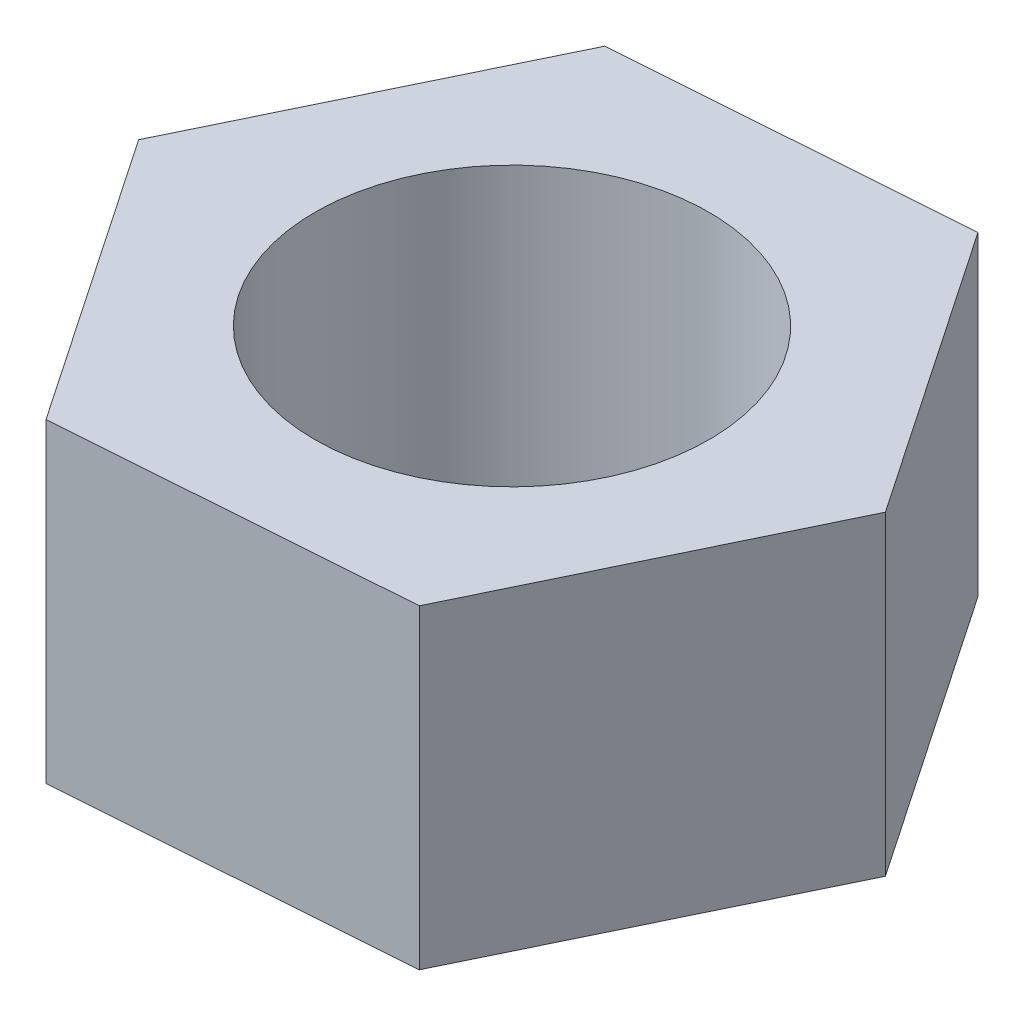
ISO-10303-21;
HEADER;
FILE_DESCRIPTION(('STEP AP214'),'2;1');
FILE_NAME('part.step','',(''),(''),'','','');
FILE_SCHEMA(('AUTOMOTIVE_DESIGN { 1 0 10303 214 1 1 1 1 }'));
ENDSEC;
DATA;
#1=APPLICATION_CONTEXT('core data for automotive mechanical design processes');
#2=APPLICATION_PROTOCOL_DEFINITION('international standard','automotive_design',2000,#1);
#3=PRODUCT_CONTEXT('',#1,'mechanical');
#4=PRODUCT('Part','Part','',(#3));
#5=PRODUCT_RELATED_PRODUCT_CATEGORY('part','',(#4));
#6=PRODUCT_DEFINITION_FORMATION('','',#4);
#7=PRODUCT_DEFINITION_CONTEXT('part definition',#1,'design');
#8=PRODUCT_DEFINITION('design','',#6,#7);
#9=PRODUCT_DEFINITION_SHAPE('','',#8);
#10=(LENGTH_UNIT() NAMED_UNIT(*) SI_UNIT(.MILLI.,.METRE.));
#11=(NAMED_UNIT(*) PLANE_ANGLE_UNIT() SI_UNIT($,.RADIAN.));
#12=(NAMED_UNIT(*) SI_UNIT($,.STERADIAN.) SOLID_ANGLE_UNIT());
#13=UNCERTAINTY_MEASURE_WITH_UNIT(LENGTH_MEASURE(1.E-05),#10,'distance_accuracy_value','');
#14=(GEOMETRIC_REPRESENTATION_CONTEXT(3) GLOBAL_UNCERTAINTY_ASSIGNED_CONTEXT((#13)) GLOBAL_UNIT_ASSIGNED_CONTEXT((#10,
#11,#12)) REPRESENTATION_CONTEXT('',''));
#15=CARTESIAN_POINT('',(0.,0.,0.));
#16=DIRECTION('',(0.,0.,1.));
#17=DIRECTION('',(1.,0.,0.));
#18=AXIS2_PLACEMENT_3D('',#15,#16,#17);
#19=CARTESIAN_POINT('',(-11.5663582299419,24.,23.907168185086));
#20=DIRECTION('',(-0.072927774693884,0.,-0.997337224652824));
#21=DIRECTION('',(-0.997337224652824,0.,0.072927774693884));
#22=AXIS2_PLACEMENT_3D('',#19,#20,#21);
#23=PLANE('',#22);
#24=DIRECTION('',(0.997337224652824,0.,-0.072927774693884));
#25=VECTOR('',#24,1.);
#26=CARTESIAN_POINT('',(-11.5663582299419,0.,23.907168185086));
#27=LINE('',#26,#25);
#28=CARTESIAN_POINT('',(-11.5663582299419,0.,23.907168185086));
#29=VERTEX_POINT('',#28);
#30=CARTESIAN_POINT('',(14.9210358658606,0.,21.970344148944));
#31=VERTEX_POINT('',#30);
#32=EDGE_CURVE('E115',#29,#31,#27,.T.);
#33=ORIENTED_EDGE('',*,*,#32,.T.);
#34=DIRECTION('',(0.,-1.,0.));
#35=VECTOR('',#34,1.);
#36=CARTESIAN_POINT('',(14.9210358658606,24.,21.970344148944));
#37=LINE('',#36,#35);
#38=CARTESIAN_POINT('',(14.9210358658606,24.,21.970344148944));
#39=VERTEX_POINT('',#38);
#40=EDGE_CURVE('E11',#39,#31,#37,.T.);
#41=ORIENTED_EDGE('',*,*,#40,.F.);
#42=DIRECTION('',(0.997337224652824,0.,-0.072927774693884));
#43=VECTOR('',#42,1.);
#44=CARTESIAN_POINT('',(-11.5663582299419,24.,23.907168185086));
#45=LINE('',#44,#43);
#46=CARTESIAN_POINT('',(-11.5663582299419,24.,23.907168185086));
#47=VERTEX_POINT('',#46);
#48=EDGE_CURVE('E126',#47,#39,#45,.T.);
#49=ORIENTED_EDGE('',*,*,#48,.F.);
#50=DIRECTION('',(0.,-1.,0.));
#51=VECTOR('',#50,1.);
#52=CARTESIAN_POINT('',(-11.5663582299419,24.,23.907168185086));
#53=LINE('',#52,#51);
#54=EDGE_CURVE('E111',#47,#29,#53,.T.);
#55=ORIENTED_EDGE('',*,*,#54,.T.);
#56=EDGE_LOOP('',(#33,#41,#49,#55));
#57=FACE_BOUND('',#56,.T.);
#58=ADVANCED_FACE('F31',(#57),#23,.F.);
#59=CARTESIAN_POINT('',(14.9210358658606,24.,21.970344148944));
#60=DIRECTION('',(-0.900183260036155,0.,-0.43551130680004));
#61=DIRECTION('',(-0.435511306800041,0.,0.900183260036156));
#62=AXIS2_PLACEMENT_3D('',#59,#60,#61);
#63=PLANE('',#62);
#64=DIRECTION('',(0.435511306800041,0.,-0.900183260036156));
#65=VECTOR('',#64,1.);
#66=CARTESIAN_POINT('',(14.9210358658606,0.,21.970344148944));
#67=LINE('',#66,#65);
#68=CARTESIAN_POINT('',(26.4873940958026,0.,-1.93682403614206));
#69=VERTEX_POINT('',#68);
#70=EDGE_CURVE('E118',#31,#69,#67,.T.);
#71=ORIENTED_EDGE('',*,*,#70,.T.);
#72=DIRECTION('',(0.,-1.,0.));
#73=VECTOR('',#72,1.);
#74=CARTESIAN_POINT('',(26.4873940958026,24.,-1.93682403614206));
#75=LINE('',#74,#73);
#76=CARTESIAN_POINT('',(26.4873940958026,24.,-1.93682403614206));
#77=VERTEX_POINT('',#76);
#78=EDGE_CURVE('E39',#77,#69,#75,.T.);
#79=ORIENTED_EDGE('',*,*,#78,.F.);
#80=DIRECTION('',(0.435511306800041,0.,-0.900183260036156));
#81=VECTOR('',#80,1.);
#82=CARTESIAN_POINT('',(14.9210358658606,24.,21.970344148944));
#83=LINE('',#82,#81);
#84=EDGE_CURVE('E84',#39,#77,#83,.T.);
#85=ORIENTED_EDGE('',*,*,#84,.F.);
#86=ORIENTED_EDGE('',*,*,#40,.T.);
#87=EDGE_LOOP('',(#71,#79,#85,#86));
#88=FACE_BOUND('',#87,.T.);
#89=ADVANCED_FACE('F151',(#88),#63,.F.);
#90=CARTESIAN_POINT('',(26.4873940958026,24.,-1.93682403614206));
#91=DIRECTION('',(-0.827255485342272,0.,0.561825917852784));
#92=DIRECTION('',(0.561825917852784,0.,0.827255485342272));
#93=AXIS2_PLACEMENT_3D('',#90,#91,#92);
#94=PLANE('',#93);
#95=DIRECTION('',(-0.561825917852784,0.,-0.827255485342272));
#96=VECTOR('',#95,1.);
#97=CARTESIAN_POINT('',(26.4873940958026,0.,-1.93682403614206));
#98=LINE('',#97,#96);
#99=CARTESIAN_POINT('',(11.5663582299419,0.,-23.907168185086));
#100=VERTEX_POINT('',#99);
#101=EDGE_CURVE('E121',#69,#100,#98,.T.);
#102=ORIENTED_EDGE('',*,*,#101,.T.);
#103=DIRECTION('',(0.,-1.,0.));
#104=VECTOR('',#103,1.);
#105=CARTESIAN_POINT('',(11.5663582299419,24.,-23.907168185086));
#106=LINE('',#105,#104);
#107=CARTESIAN_POINT('',(11.5663582299419,24.,-23.907168185086));
#108=VERTEX_POINT('',#107);
#109=EDGE_CURVE('E106',#108,#100,#106,.T.);
#110=ORIENTED_EDGE('',*,*,#109,.F.);
#111=DIRECTION('',(-0.561825917852784,0.,-0.827255485342272));
#112=VECTOR('',#111,1.);
#113=CARTESIAN_POINT('',(26.4873940958026,24.,-1.93682403614206));
#114=LINE('',#113,#112);
#115=EDGE_CURVE('E97',#77,#108,#114,.T.);
#116=ORIENTED_EDGE('',*,*,#115,.F.);
#117=ORIENTED_EDGE('',*,*,#78,.T.);
#118=EDGE_LOOP('',(#102,#110,#116,#117));
#119=FACE_BOUND('',#118,.T.);
#120=ADVANCED_FACE('F132',(#119),#94,.F.);
#121=CARTESIAN_POINT('',(11.5663582299419,24.,-23.907168185086));
#122=DIRECTION('',(0.0729277746938836,0.,0.997337224652824));
#123=DIRECTION('',(0.997337224652824,0.,-0.0729277746938836));
#124=AXIS2_PLACEMENT_3D('',#121,#122,#123);
#125=PLANE('',#124);
#126=DIRECTION('',(-0.997337224652824,0.,0.0729277746938836));
#127=VECTOR('',#126,1.);
#128=CARTESIAN_POINT('',(11.5663582299419,0.,-23.907168185086));
#129=LINE('',#128,#127);
#130=CARTESIAN_POINT('',(-14.9210358658606,0.,-21.9703441489439));
#131=VERTEX_POINT('',#130);
#132=EDGE_CURVE('E105',#100,#131,#129,.T.);
#133=ORIENTED_EDGE('',*,*,#132,.T.);
#134=DIRECTION('',(0.,-1.,0.));
#135=VECTOR('',#134,1.);
#136=CARTESIAN_POINT('',(-14.9210358658606,24.,-21.9703441489439));
#137=LINE('',#136,#135);
#138=CARTESIAN_POINT('',(-14.9210358658606,24.,-21.9703441489439));
#139=VERTEX_POINT('',#138);
#140=EDGE_CURVE('E102',#139,#131,#137,.T.);
#141=ORIENTED_EDGE('',*,*,#140,.F.);
#142=DIRECTION('',(-0.997337224652824,0.,0.0729277746938836));
#143=VECTOR('',#142,1.);
#144=CARTESIAN_POINT('',(11.5663582299419,24.,-23.907168185086));
#145=LINE('',#144,#143);
#146=EDGE_CURVE('E91',#108,#139,#145,.T.);
#147=ORIENTED_EDGE('',*,*,#146,.F.);
#148=ORIENTED_EDGE('',*,*,#109,.T.);
#149=EDGE_LOOP('',(#133,#141,#147,#148));
#150=FACE_BOUND('',#149,.T.);
#151=ADVANCED_FACE('F103',(#150),#125,.F.);
#152=CARTESIAN_POINT('',(-14.9210358658606,24.,-21.9703441489439));
#153=DIRECTION('',(0.900183260036156,0.,0.43551130680004));
#154=DIRECTION('',(0.43551130680004,0.,-0.900183260036156));
#155=AXIS2_PLACEMENT_3D('',#152,#153,#154);
#156=PLANE('',#155);
#157=DIRECTION('',(-0.43551130680004,0.,0.900183260036156));
#158=VECTOR('',#157,1.);
#159=CARTESIAN_POINT('',(-14.9210358658606,0.,-21.9703441489439));
#160=LINE('',#159,#158);
#161=CARTESIAN_POINT('',(-26.4873940958025,0.,1.93682403614207));
#162=VERTEX_POINT('',#161);
#163=EDGE_CURVE('E70',#131,#162,#160,.T.);
#164=ORIENTED_EDGE('',*,*,#163,.T.);
#165=DIRECTION('',(0.,-1.,0.));
#166=VECTOR('',#165,1.);
#167=CARTESIAN_POINT('',(-26.4873940958025,24.,1.93682403614207));
#168=LINE('',#167,#166);
#169=CARTESIAN_POINT('',(-26.4873940958025,24.,1.93682403614207));
#170=VERTEX_POINT('',#169);
#171=EDGE_CURVE('E107',#170,#162,#168,.T.);
#172=ORIENTED_EDGE('',*,*,#171,.F.);
#173=DIRECTION('',(-0.43551130680004,0.,0.900183260036156));
#174=VECTOR('',#173,1.);
#175=CARTESIAN_POINT('',(-14.9210358658606,24.,-21.9703441489439));
#176=LINE('',#175,#174);
#177=EDGE_CURVE('E95',#139,#170,#176,.T.);
#178=ORIENTED_EDGE('',*,*,#177,.F.);
#179=ORIENTED_EDGE('',*,*,#140,.T.);
#180=EDGE_LOOP('',(#164,#172,#178,#179));
#181=FACE_BOUND('',#180,.T.);
#182=ADVANCED_FACE('F109',(#181),#156,.F.);
#183=CARTESIAN_POINT('',(-26.4873940958025,24.,1.93682403614207));
#184=DIRECTION('',(0.827255485342272,0.,-0.561825917852783));
#185=DIRECTION('',(-0.561825917852783,0.,-0.827255485342272));
#186=AXIS2_PLACEMENT_3D('',#183,#184,#185);
#187=PLANE('',#186);
#188=DIRECTION('',(0.561825917852783,0.,0.827255485342272));
#189=VECTOR('',#188,1.);
#190=CARTESIAN_POINT('',(-26.4873940958025,0.,1.93682403614207));
#191=LINE('',#190,#189);
#192=EDGE_CURVE('E76',#162,#29,#191,.T.);
#193=ORIENTED_EDGE('',*,*,#192,.T.);
#194=ORIENTED_EDGE('',*,*,#54,.F.);
#195=DIRECTION('',(0.561825917852783,0.,0.827255485342272));
#196=VECTOR('',#195,1.);
#197=CARTESIAN_POINT('',(-26.4873940958025,24.,1.93682403614207));
#198=LINE('',#197,#196);
#199=EDGE_CURVE('E47',#170,#47,#198,.T.);
#200=ORIENTED_EDGE('',*,*,#199,.F.);
#201=ORIENTED_EDGE('',*,*,#171,.T.);
#202=EDGE_LOOP('',(#193,#194,#200,#201));
#203=FACE_BOUND('',#202,.T.);
#204=ADVANCED_FACE('F139',(#203),#187,.F.);
#205=CARTESIAN_POINT('',(14.9210358658606,24.,21.970344148944));
#206=DIRECTION('',(0.,1.,0.));
#207=DIRECTION('',(0.,0.,1.));
#208=AXIS2_PLACEMENT_3D('',#205,#206,#207);
#209=PLANE('',#208);
#210=CARTESIAN_POINT('',(0.,24.,0.));
#211=DIRECTION('',(0.,1.,0.));
#212=DIRECTION('',(0.,0.,1.));
#213=AXIS2_PLACEMENT_3D('',#210,#211,#212);
#214=CIRCLE('',#213,15.);
#215=CARTESIAN_POINT('',(0.,24.,15.));
#216=VERTEX_POINT('',#215);
#217=EDGE_CURVE('E206',#216,#216,#214,.T.);
#218=ORIENTED_EDGE('',*,*,#217,.F.);
#219=EDGE_LOOP('',(#218));
#220=FACE_BOUND('',#219,.T.);
#221=ORIENTED_EDGE('',*,*,#48,.T.);
#222=ORIENTED_EDGE('',*,*,#84,.T.);
#223=ORIENTED_EDGE('',*,*,#115,.T.);
#224=ORIENTED_EDGE('',*,*,#146,.T.);
#225=ORIENTED_EDGE('',*,*,#177,.T.);
#226=ORIENTED_EDGE('',*,*,#199,.T.);
#227=EDGE_LOOP('',(#221,#222,#223,#224,#225,#226));
#228=FACE_BOUND('',#227,.T.);
#229=ADVANCED_FACE('F93',(#220,#228),#209,.T.);
#230=CARTESIAN_POINT('',(14.9210358658606,0.,21.970344148944));
#231=DIRECTION('',(0.,1.,0.));
#232=DIRECTION('',(0.,0.,1.));
#233=AXIS2_PLACEMENT_3D('',#230,#231,#232);
#234=PLANE('',#233);
#235=CARTESIAN_POINT('',(0.,0.,0.));
#236=DIRECTION('',(0.,1.,0.));
#237=DIRECTION('',(0.,0.,1.));
#238=AXIS2_PLACEMENT_3D('',#235,#236,#237);
#239=CIRCLE('',#238,15.);
#240=CARTESIAN_POINT('',(0.,0.,15.));
#241=VERTEX_POINT('',#240);
#242=EDGE_CURVE('E119',#241,#241,#239,.T.);
#243=ORIENTED_EDGE('',*,*,#242,.T.);
#244=EDGE_LOOP('',(#243));
#245=FACE_BOUND('',#244,.T.);
#246=ORIENTED_EDGE('',*,*,#32,.F.);
#247=ORIENTED_EDGE('',*,*,#192,.F.);
#248=ORIENTED_EDGE('',*,*,#163,.F.);
#249=ORIENTED_EDGE('',*,*,#132,.F.);
#250=ORIENTED_EDGE('',*,*,#101,.F.);
#251=ORIENTED_EDGE('',*,*,#70,.F.);
#252=EDGE_LOOP('',(#246,#247,#248,#249,#250,#251));
#253=FACE_BOUND('',#252,.T.);
#254=ADVANCED_FACE('F135',(#245,#253),#234,.F.);
#255=CARTESIAN_POINT('',(0.,0.,0.));
#256=DIRECTION('',(0.,1.,0.));
#257=DIRECTION('',(0.,0.,1.));
#258=AXIS2_PLACEMENT_3D('',#255,#256,#257);
#259=CYLINDRICAL_SURFACE('',#258,15.);
#260=ORIENTED_EDGE('',*,*,#242,.F.);
#261=EDGE_LOOP('',(#260));
#262=FACE_BOUND('',#261,.T.);
#263=ORIENTED_EDGE('',*,*,#217,.T.);
#264=EDGE_LOOP('',(#263));
#265=FACE_BOUND('',#264,.T.);
#266=ADVANCED_FACE('F188',(#262,#265),#259,.F.);
#267=CLOSED_SHELL('',(#58,#89,#120,#151,#182,#204,#229,#254,#266));
#268=MANIFOLD_SOLID_BREP('B2',#267);
#269=ADVANCED_BREP_SHAPE_REPRESENTATION('',(#18,#268),#14);
#270=SHAPE_DEFINITION_REPRESENTATION(#9,#269);
ENDSEC;
END-ISO-10303-21;
